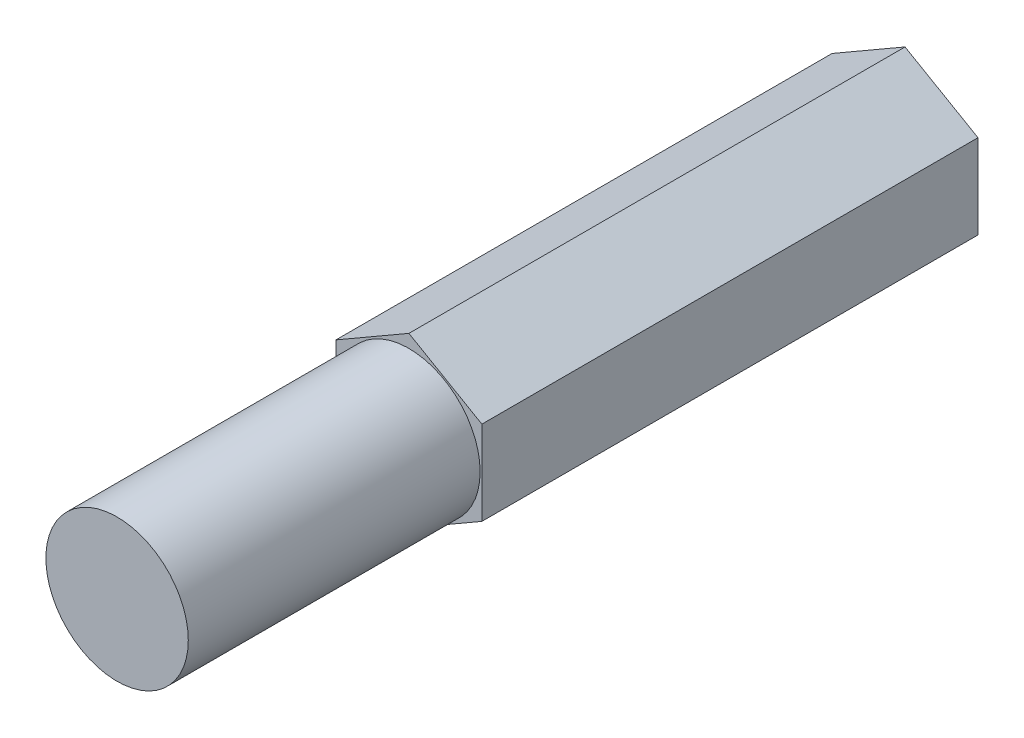
ISO-10303-21;
HEADER;
FILE_DESCRIPTION(('STEP AP214'),'2;1');
FILE_NAME('part.step','',(''),(''),'','','');
FILE_SCHEMA(('AUTOMOTIVE_DESIGN { 1 0 10303 214 1 1 1 1 }'));
ENDSEC;
DATA;
#1=APPLICATION_CONTEXT('core data for automotive mechanical design processes');
#2=APPLICATION_PROTOCOL_DEFINITION('international standard','automotive_design',2000,#1);
#3=PRODUCT_CONTEXT('',#1,'mechanical');
#4=PRODUCT('Part','Part','',(#3));
#5=PRODUCT_RELATED_PRODUCT_CATEGORY('part','',(#4));
#6=PRODUCT_DEFINITION_FORMATION('','',#4);
#7=PRODUCT_DEFINITION_CONTEXT('part definition',#1,'design');
#8=PRODUCT_DEFINITION('design','',#6,#7);
#9=PRODUCT_DEFINITION_SHAPE('','',#8);
#10=(LENGTH_UNIT() NAMED_UNIT(*) SI_UNIT(.MILLI.,.METRE.));
#11=(NAMED_UNIT(*) PLANE_ANGLE_UNIT() SI_UNIT($,.RADIAN.));
#12=(NAMED_UNIT(*) SI_UNIT($,.STERADIAN.) SOLID_ANGLE_UNIT());
#13=UNCERTAINTY_MEASURE_WITH_UNIT(LENGTH_MEASURE(1.E-05),#10,'distance_accuracy_value','');
#14=(GEOMETRIC_REPRESENTATION_CONTEXT(3) GLOBAL_UNCERTAINTY_ASSIGNED_CONTEXT((#13)) GLOBAL_UNIT_ASSIGNED_CONTEXT((#10,
#11,#12)) REPRESENTATION_CONTEXT('',''));
#15=CARTESIAN_POINT('',(0.,0.,0.));
#16=DIRECTION('',(0.,0.,1.));
#17=DIRECTION('',(1.,0.,0.));
#18=AXIS2_PLACEMENT_3D('',#15,#16,#17);
#19=CARTESIAN_POINT('',(0.,0.,-12.7));
#20=DIRECTION('',(0.,0.,1.));
#21=DIRECTION('',(1.,0.,0.));
#22=AXIS2_PLACEMENT_3D('',#19,#20,#21);
#23=CYLINDRICAL_SURFACE('',#22,3.0988);
#24=CARTESIAN_POINT('',(0.,0.,-12.7));
#25=DIRECTION('',(0.,0.,1.));
#26=DIRECTION('',(1.,0.,0.));
#27=AXIS2_PLACEMENT_3D('',#24,#25,#26);
#28=CIRCLE('',#27,3.0988);
#29=CARTESIAN_POINT('',(3.0988,0.,-12.7));
#30=VERTEX_POINT('',#29);
#31=EDGE_CURVE('E54',#30,#30,#28,.T.);
#32=ORIENTED_EDGE('',*,*,#31,.T.);
#33=EDGE_LOOP('',(#32));
#34=FACE_BOUND('',#33,.T.);
#35=CARTESIAN_POINT('',(0.,0.,0.));
#36=DIRECTION('',(0.,0.,1.));
#37=DIRECTION('',(1.,0.,0.));
#38=AXIS2_PLACEMENT_3D('',#35,#36,#37);
#39=CIRCLE('',#38,3.0988);
#40=CARTESIAN_POINT('',(3.0988,0.,0.));
#41=VERTEX_POINT('',#40);
#42=EDGE_CURVE('E13',#41,#41,#39,.T.);
#43=ORIENTED_EDGE('',*,*,#42,.F.);
#44=EDGE_LOOP('',(#43));
#45=FACE_BOUND('',#44,.T.);
#46=ADVANCED_FACE('F46',(#34,#45),#23,.T.);
#47=CARTESIAN_POINT('',(0.,0.,0.));
#48=DIRECTION('',(0.,0.,1.));
#49=DIRECTION('',(1.,0.,0.));
#50=AXIS2_PLACEMENT_3D('',#47,#48,#49);
#51=PLANE('',#50);
#52=ORIENTED_EDGE('',*,*,#42,.T.);
#53=EDGE_LOOP('',(#52));
#54=FACE_BOUND('',#53,.T.);
#55=ADVANCED_FACE('F174',(#54),#51,.T.);
#56=CARTESIAN_POINT('',(-3.175,1.83308710467706,-34.29));
#57=DIRECTION('',(0.5,-0.866025403784439,0.));
#58=DIRECTION('',(0.866025403784439,0.5,0.));
#59=AXIS2_PLACEMENT_3D('',#56,#57,#58);
#60=PLANE('',#59);
#61=DIRECTION('',(0.866025403784439,0.5,0.));
#62=VECTOR('',#61,1.);
#63=CARTESIAN_POINT('',(-3.175,1.83308710467706,-12.7));
#64=LINE('',#63,#62);
#65=CARTESIAN_POINT('',(-3.175,1.83308710467706,-12.7));
#66=VERTEX_POINT('',#65);
#67=CARTESIAN_POINT('',(0.,3.66617420935413,-12.7));
#68=VERTEX_POINT('',#67);
#69=EDGE_CURVE('E131',#66,#68,#64,.T.);
#70=ORIENTED_EDGE('',*,*,#69,.T.);
#71=DIRECTION('',(0.,0.,1.));
#72=VECTOR('',#71,1.);
#73=CARTESIAN_POINT('',(0.,3.66617420935413,-34.29));
#74=LINE('',#73,#72);
#75=CARTESIAN_POINT('',(0.,3.66617420935413,-34.29));
#76=VERTEX_POINT('',#75);
#77=EDGE_CURVE('E148',#76,#68,#74,.T.);
#78=ORIENTED_EDGE('',*,*,#77,.F.);
#79=DIRECTION('',(0.866025403784439,0.5,0.));
#80=VECTOR('',#79,1.);
#81=CARTESIAN_POINT('',(-3.175,1.83308710467706,-34.29));
#82=LINE('',#81,#80);
#83=CARTESIAN_POINT('',(-3.175,1.83308710467706,-34.29));
#84=VERTEX_POINT('',#83);
#85=EDGE_CURVE('E141',#84,#76,#82,.T.);
#86=ORIENTED_EDGE('',*,*,#85,.F.);
#87=DIRECTION('',(0.,0.,1.));
#88=VECTOR('',#87,1.);
#89=CARTESIAN_POINT('',(-3.175,1.83308710467706,-34.29));
#90=LINE('',#89,#88);
#91=EDGE_CURVE('E127',#84,#66,#90,.T.);
#92=ORIENTED_EDGE('',*,*,#91,.T.);
#93=EDGE_LOOP('',(#70,#78,#86,#92));
#94=FACE_BOUND('',#93,.T.);
#95=ADVANCED_FACE('F162',(#94),#60,.F.);
#96=CARTESIAN_POINT('',(0.,3.66617420935413,-34.29));
#97=DIRECTION('',(-0.5,-0.866025403784439,0.));
#98=DIRECTION('',(0.866025403784439,-0.5,0.));
#99=AXIS2_PLACEMENT_3D('',#96,#97,#98);
#100=PLANE('',#99);
#101=DIRECTION('',(0.866025403784439,-0.5,0.));
#102=VECTOR('',#101,1.);
#103=CARTESIAN_POINT('',(0.,3.66617420935413,-12.7));
#104=LINE('',#103,#102);
#105=CARTESIAN_POINT('',(3.175,1.83308710467706,-12.7));
#106=VERTEX_POINT('',#105);
#107=EDGE_CURVE('E134',#68,#106,#104,.T.);
#108=ORIENTED_EDGE('',*,*,#107,.T.);
#109=DIRECTION('',(0.,0.,1.));
#110=VECTOR('',#109,1.);
#111=CARTESIAN_POINT('',(3.175,1.83308710467706,-34.29));
#112=LINE('',#111,#110);
#113=CARTESIAN_POINT('',(3.175,1.83308710467706,-34.29));
#114=VERTEX_POINT('',#113);
#115=EDGE_CURVE('E145',#114,#106,#112,.T.);
#116=ORIENTED_EDGE('',*,*,#115,.F.);
#117=DIRECTION('',(0.866025403784439,-0.5,0.));
#118=VECTOR('',#117,1.);
#119=CARTESIAN_POINT('',(0.,3.66617420935413,-34.29));
#120=LINE('',#119,#118);
#121=EDGE_CURVE('E100',#76,#114,#120,.T.);
#122=ORIENTED_EDGE('',*,*,#121,.F.);
#123=ORIENTED_EDGE('',*,*,#77,.T.);
#124=EDGE_LOOP('',(#108,#116,#122,#123));
#125=FACE_BOUND('',#124,.T.);
#126=ADVANCED_FACE('F182',(#125),#100,.F.);
#127=CARTESIAN_POINT('',(3.175,1.83308710467706,-34.29));
#128=DIRECTION('',(-1.,0.,0.));
#129=DIRECTION('',(0.,-1.,0.));
#130=AXIS2_PLACEMENT_3D('',#127,#128,#129);
#131=PLANE('',#130);
#132=DIRECTION('',(0.,-1.,0.));
#133=VECTOR('',#132,1.);
#134=CARTESIAN_POINT('',(3.175,1.83308710467706,-12.7));
#135=LINE('',#134,#133);
#136=CARTESIAN_POINT('',(3.175,-1.83308710467706,-12.7));
#137=VERTEX_POINT('',#136);
#138=EDGE_CURVE('E136',#106,#137,#135,.T.);
#139=ORIENTED_EDGE('',*,*,#138,.T.);
#140=DIRECTION('',(0.,0.,1.));
#141=VECTOR('',#140,1.);
#142=CARTESIAN_POINT('',(3.175,-1.83308710467706,-34.29));
#143=LINE('',#142,#141);
#144=CARTESIAN_POINT('',(3.175,-1.83308710467706,-34.29));
#145=VERTEX_POINT('',#144);
#146=EDGE_CURVE('E122',#145,#137,#143,.T.);
#147=ORIENTED_EDGE('',*,*,#146,.F.);
#148=DIRECTION('',(0.,-1.,0.));
#149=VECTOR('',#148,1.);
#150=CARTESIAN_POINT('',(3.175,1.83308710467706,-34.29));
#151=LINE('',#150,#149);
#152=EDGE_CURVE('E113',#114,#145,#151,.T.);
#153=ORIENTED_EDGE('',*,*,#152,.F.);
#154=ORIENTED_EDGE('',*,*,#115,.T.);
#155=EDGE_LOOP('',(#139,#147,#153,#154));
#156=FACE_BOUND('',#155,.T.);
#157=ADVANCED_FACE('F187',(#156),#131,.F.);
#158=CARTESIAN_POINT('',(3.175,-1.83308710467706,-34.29));
#159=DIRECTION('',(-0.5,0.866025403784438,0.));
#160=DIRECTION('',(-0.866025403784438,-0.5,0.));
#161=AXIS2_PLACEMENT_3D('',#158,#159,#160);
#162=PLANE('',#161);
#163=DIRECTION('',(-0.866025403784438,-0.5,0.));
#164=VECTOR('',#163,1.);
#165=CARTESIAN_POINT('',(3.175,-1.83308710467706,-12.7));
#166=LINE('',#165,#164);
#167=CARTESIAN_POINT('',(0.,-3.66617420935413,-12.7));
#168=VERTEX_POINT('',#167);
#169=EDGE_CURVE('E121',#137,#168,#166,.T.);
#170=ORIENTED_EDGE('',*,*,#169,.T.);
#171=DIRECTION('',(0.,0.,1.));
#172=VECTOR('',#171,1.);
#173=CARTESIAN_POINT('',(0.,-3.66617420935413,-34.29));
#174=LINE('',#173,#172);
#175=CARTESIAN_POINT('',(0.,-3.66617420935413,-34.29));
#176=VERTEX_POINT('',#175);
#177=EDGE_CURVE('E118',#176,#168,#174,.T.);
#178=ORIENTED_EDGE('',*,*,#177,.F.);
#179=DIRECTION('',(-0.866025403784438,-0.5,0.));
#180=VECTOR('',#179,1.);
#181=CARTESIAN_POINT('',(3.175,-1.83308710467706,-34.29));
#182=LINE('',#181,#180);
#183=EDGE_CURVE('E107',#145,#176,#182,.T.);
#184=ORIENTED_EDGE('',*,*,#183,.F.);
#185=ORIENTED_EDGE('',*,*,#146,.T.);
#186=EDGE_LOOP('',(#170,#178,#184,#185));
#187=FACE_BOUND('',#186,.T.);
#188=ADVANCED_FACE('F119',(#187),#162,.F.);
#189=CARTESIAN_POINT('',(0.,-3.66617420935413,-34.29));
#190=DIRECTION('',(0.5,0.866025403784439,0.));
#191=DIRECTION('',(-0.866025403784439,0.5,0.));
#192=AXIS2_PLACEMENT_3D('',#189,#190,#191);
#193=PLANE('',#192);
#194=DIRECTION('',(-0.866025403784439,0.5,0.));
#195=VECTOR('',#194,1.);
#196=CARTESIAN_POINT('',(0.,-3.66617420935413,-12.7));
#197=LINE('',#196,#195);
#198=CARTESIAN_POINT('',(-3.175,-1.83308710467706,-12.7));
#199=VERTEX_POINT('',#198);
#200=EDGE_CURVE('E85',#168,#199,#197,.T.);
#201=ORIENTED_EDGE('',*,*,#200,.T.);
#202=DIRECTION('',(0.,0.,1.));
#203=VECTOR('',#202,1.);
#204=CARTESIAN_POINT('',(-3.175,-1.83308710467706,-34.29));
#205=LINE('',#204,#203);
#206=CARTESIAN_POINT('',(-3.175,-1.83308710467706,-34.29));
#207=VERTEX_POINT('',#206);
#208=EDGE_CURVE('E123',#207,#199,#205,.T.);
#209=ORIENTED_EDGE('',*,*,#208,.F.);
#210=DIRECTION('',(-0.866025403784439,0.5,0.));
#211=VECTOR('',#210,1.);
#212=CARTESIAN_POINT('',(0.,-3.66617420935413,-34.29));
#213=LINE('',#212,#211);
#214=EDGE_CURVE('E111',#176,#207,#213,.T.);
#215=ORIENTED_EDGE('',*,*,#214,.F.);
#216=ORIENTED_EDGE('',*,*,#177,.T.);
#217=EDGE_LOOP('',(#201,#209,#215,#216));
#218=FACE_BOUND('',#217,.T.);
#219=ADVANCED_FACE('F125',(#218),#193,.F.);
#220=CARTESIAN_POINT('',(-3.175,-1.83308710467706,-34.29));
#221=DIRECTION('',(1.,0.,0.));
#222=DIRECTION('',(0.,0.,-1.));
#223=AXIS2_PLACEMENT_3D('',#220,#221,#222);
#224=PLANE('',#223);
#225=DIRECTION('',(0.,1.,0.));
#226=VECTOR('',#225,1.);
#227=CARTESIAN_POINT('',(-3.175,-1.83308710467706,-12.7));
#228=LINE('',#227,#226);
#229=EDGE_CURVE('E91',#199,#66,#228,.T.);
#230=ORIENTED_EDGE('',*,*,#229,.T.);
#231=ORIENTED_EDGE('',*,*,#91,.F.);
#232=DIRECTION('',(0.,1.,0.));
#233=VECTOR('',#232,1.);
#234=CARTESIAN_POINT('',(-3.175,-1.83308710467706,-34.29));
#235=LINE('',#234,#233);
#236=EDGE_CURVE('E62',#207,#84,#235,.T.);
#237=ORIENTED_EDGE('',*,*,#236,.F.);
#238=ORIENTED_EDGE('',*,*,#208,.T.);
#239=EDGE_LOOP('',(#230,#231,#237,#238));
#240=FACE_BOUND('',#239,.T.);
#241=ADVANCED_FACE('F164',(#240),#224,.F.);
#242=CARTESIAN_POINT('',(0.,0.,-34.29));
#243=DIRECTION('',(0.,0.,-1.));
#244=DIRECTION('',(-1.,0.,0.));
#245=AXIS2_PLACEMENT_3D('',#242,#243,#244);
#246=PLANE('',#245);
#247=ORIENTED_EDGE('',*,*,#85,.T.);
#248=ORIENTED_EDGE('',*,*,#121,.T.);
#249=ORIENTED_EDGE('',*,*,#152,.T.);
#250=ORIENTED_EDGE('',*,*,#183,.T.);
#251=ORIENTED_EDGE('',*,*,#214,.T.);
#252=ORIENTED_EDGE('',*,*,#236,.T.);
#253=EDGE_LOOP('',(#247,#248,#249,#250,#251,#252));
#254=FACE_BOUND('',#253,.T.);
#255=ADVANCED_FACE('F109',(#254),#246,.T.);
#256=CARTESIAN_POINT('',(0.,0.,-12.7));
#257=DIRECTION('',(0.,0.,-1.));
#258=DIRECTION('',(-1.,0.,0.));
#259=AXIS2_PLACEMENT_3D('',#256,#257,#258);
#260=PLANE('',#259);
#261=ORIENTED_EDGE('',*,*,#31,.F.);
#262=EDGE_LOOP('',(#261));
#263=FACE_BOUND('',#262,.T.);
#264=ORIENTED_EDGE('',*,*,#69,.F.);
#265=ORIENTED_EDGE('',*,*,#229,.F.);
#266=ORIENTED_EDGE('',*,*,#200,.F.);
#267=ORIENTED_EDGE('',*,*,#169,.F.);
#268=ORIENTED_EDGE('',*,*,#138,.F.);
#269=ORIENTED_EDGE('',*,*,#107,.F.);
#270=EDGE_LOOP('',(#264,#265,#266,#267,#268,#269));
#271=FACE_BOUND('',#270,.T.);
#272=ADVANCED_FACE('F154',(#263,#271),#260,.F.);
#273=CLOSED_SHELL('',(#46,#55,#95,#126,#157,#188,#219,#241,#255,#272));
#274=MANIFOLD_SOLID_BREP('B2',#273);
#275=ADVANCED_BREP_SHAPE_REPRESENTATION('',(#18,#274),#14);
#276=SHAPE_DEFINITION_REPRESENTATION(#9,#275);
ENDSEC;
END-ISO-10303-21;
